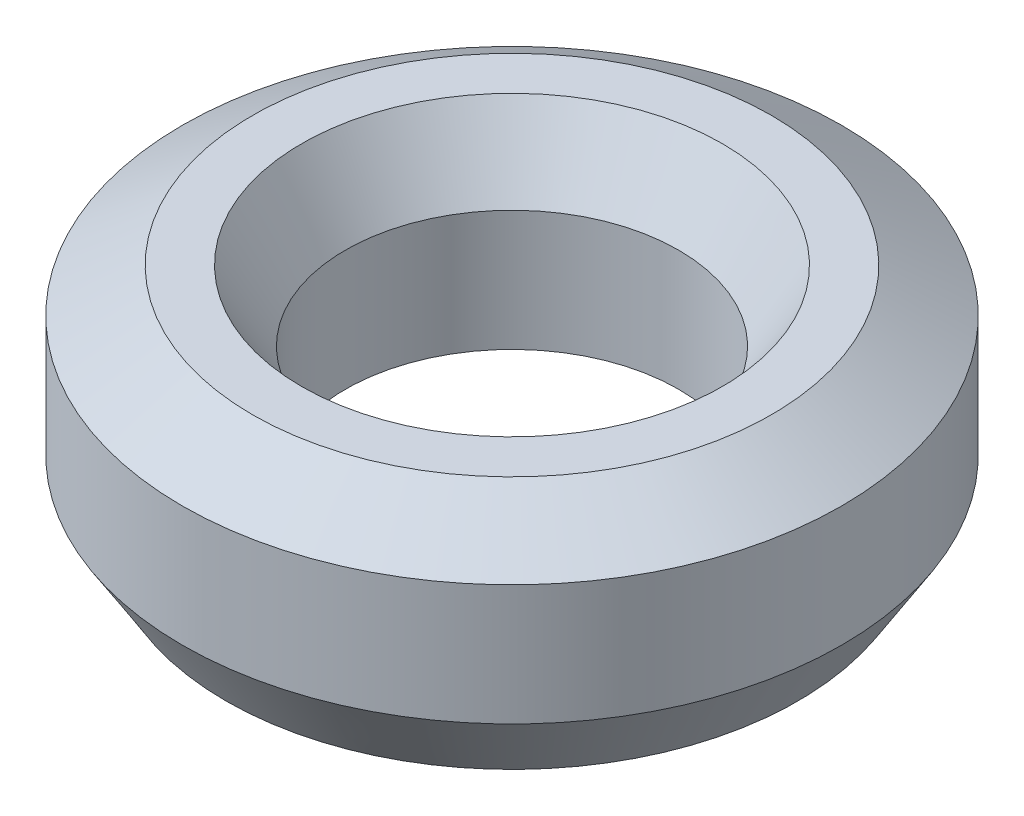
ISO-10303-21;
HEADER;
FILE_DESCRIPTION(('STEP AP214'),'2;1');
FILE_NAME('part.step','',(''),(''),'','','');
FILE_SCHEMA(('AUTOMOTIVE_DESIGN { 1 0 10303 214 1 1 1 1 }'));
ENDSEC;
DATA;
#1=APPLICATION_CONTEXT('core data for automotive mechanical design processes');
#2=APPLICATION_PROTOCOL_DEFINITION('international standard','automotive_design',2000,#1);
#3=PRODUCT_CONTEXT('',#1,'mechanical');
#4=PRODUCT('Part','Part','',(#3));
#5=PRODUCT_RELATED_PRODUCT_CATEGORY('part','',(#4));
#6=PRODUCT_DEFINITION_FORMATION('','',#4);
#7=PRODUCT_DEFINITION_CONTEXT('part definition',#1,'design');
#8=PRODUCT_DEFINITION('design','',#6,#7);
#9=PRODUCT_DEFINITION_SHAPE('','',#8);
#10=(LENGTH_UNIT() NAMED_UNIT(*) SI_UNIT(.MILLI.,.METRE.));
#11=(NAMED_UNIT(*) PLANE_ANGLE_UNIT() SI_UNIT($,.RADIAN.));
#12=(NAMED_UNIT(*) SI_UNIT($,.STERADIAN.) SOLID_ANGLE_UNIT());
#13=UNCERTAINTY_MEASURE_WITH_UNIT(LENGTH_MEASURE(1.E-05),#10,'distance_accuracy_value','');
#14=(GEOMETRIC_REPRESENTATION_CONTEXT(3) GLOBAL_UNCERTAINTY_ASSIGNED_CONTEXT((#13)) GLOBAL_UNIT_ASSIGNED_CONTEXT((#10,
#11,#12)) REPRESENTATION_CONTEXT('',''));
#15=CARTESIAN_POINT('',(0.,0.,0.));
#16=DIRECTION('',(0.,0.,1.));
#17=DIRECTION('',(1.,0.,0.));
#18=AXIS2_PLACEMENT_3D('',#15,#16,#17);
#19=CARTESIAN_POINT('',(0.,19.5687559896404,0.));
#20=DIRECTION('',(0.,-1.,0.));
#21=DIRECTION('',(0.,0.,-1.));
#22=AXIS2_PLACEMENT_3D('',#19,#20,#21);
#23=CYLINDRICAL_SURFACE('',#22,27.5);
#24=CARTESIAN_POINT('',(0.,5.86489268810925,0.));
#25=DIRECTION('',(0.,1.,0.));
#26=DIRECTION('',(0.,0.,1.));
#27=AXIS2_PLACEMENT_3D('',#24,#25,#26);
#28=CIRCLE('',#27,27.5);
#29=CARTESIAN_POINT('',(0.,5.86489268810925,27.5));
#30=VERTEX_POINT('',#29);
#31=EDGE_CURVE('E10',#30,#30,#28,.T.);
#32=ORIENTED_EDGE('',*,*,#31,.T.);
#33=EDGE_LOOP('',(#32));
#34=FACE_BOUND('',#33,.T.);
#35=CARTESIAN_POINT('',(0.,15.9188003643487,0.));
#36=DIRECTION('',(0.,1.,0.));
#37=DIRECTION('',(0.,0.,1.));
#38=AXIS2_PLACEMENT_3D('',#35,#36,#37);
#39=CIRCLE('',#38,27.5);
#40=CARTESIAN_POINT('',(0.,15.9188003643487,27.5));
#41=VERTEX_POINT('',#40);
#42=EDGE_CURVE('E50',#41,#41,#39,.F.);
#43=ORIENTED_EDGE('',*,*,#42,.T.);
#44=EDGE_LOOP('',(#43));
#45=FACE_BOUND('',#44,.T.);
#46=ADVANCED_FACE('F39',(#34,#45),#23,.T.);
#47=CARTESIAN_POINT('',(0.,19.5687559896404,0.));
#48=DIRECTION('',(0.,1.,0.));
#49=DIRECTION('',(0.,0.,1.));
#50=AXIS2_PLACEMENT_3D('',#47,#48,#49);
#51=PLANE('',#50);
#52=CARTESIAN_POINT('',(0.,19.5687559896404,0.));
#53=DIRECTION('',(0.,1.,0.));
#54=DIRECTION('',(0.,0.,1.));
#55=AXIS2_PLACEMENT_3D('',#52,#53,#54);
#56=CIRCLE('',#55,17.5476063171311);
#57=CARTESIAN_POINT('',(0.,19.5687559896404,17.5476063171311));
#58=VERTEX_POINT('',#57);
#59=EDGE_CURVE('E58',#58,#58,#56,.F.);
#60=ORIENTED_EDGE('',*,*,#59,.T.);
#61=EDGE_LOOP('',(#60));
#62=FACE_BOUND('',#61,.T.);
#63=CARTESIAN_POINT('',(0.,19.5687559896404,0.));
#64=DIRECTION('',(0.,1.,0.));
#65=DIRECTION('',(0.,0.,1.));
#66=AXIS2_PLACEMENT_3D('',#63,#64,#65);
#67=CIRCLE('',#66,21.6351073118907);
#68=CARTESIAN_POINT('',(0.,19.5687559896404,21.6351073118907));
#69=VERTEX_POINT('',#68);
#70=EDGE_CURVE('E61',#69,#69,#67,.T.);
#71=ORIENTED_EDGE('',*,*,#70,.T.);
#72=EDGE_LOOP('',(#71));
#73=FACE_BOUND('',#72,.T.);
#74=ADVANCED_FACE('F88',(#62,#73),#51,.T.);
#75=CARTESIAN_POINT('',(0.,0.,0.));
#76=DIRECTION('',(0.,1.,0.));
#77=DIRECTION('',(0.,0.,1.));
#78=AXIS2_PLACEMENT_3D('',#75,#76,#77);
#79=PLANE('',#78);
#80=CARTESIAN_POINT('',(0.,0.,0.));
#81=DIRECTION('',(0.,1.,0.));
#82=DIRECTION('',(0.,0.,1.));
#83=AXIS2_PLACEMENT_3D('',#80,#81,#82);
#84=CIRCLE('',#83,19.7625433799486);
#85=CARTESIAN_POINT('',(0.,0.,19.7625433799486));
#86=VERTEX_POINT('',#85);
#87=EDGE_CURVE('E51',#86,#86,#84,.T.);
#88=ORIENTED_EDGE('',*,*,#87,.T.);
#89=EDGE_LOOP('',(#88));
#90=FACE_BOUND('',#89,.T.);
#91=CARTESIAN_POINT('',(0.,0.,0.));
#92=DIRECTION('',(0.,1.,0.));
#93=DIRECTION('',(0.,0.,1.));
#94=AXIS2_PLACEMENT_3D('',#91,#92,#93);
#95=CIRCLE('',#94,23.8500443747083);
#96=CARTESIAN_POINT('',(0.,0.,23.8500443747083));
#97=VERTEX_POINT('',#96);
#98=EDGE_CURVE('E54',#97,#97,#95,.F.);
#99=ORIENTED_EDGE('',*,*,#98,.T.);
#100=EDGE_LOOP('',(#99));
#101=FACE_BOUND('',#100,.T.);
#102=ADVANCED_FACE('F83',(#90,#101),#79,.F.);
#103=CARTESIAN_POINT('',(0.,19.5687559896404,0.));
#104=DIRECTION('',(0.,-1.,0.));
#105=DIRECTION('',(0.,0.,-1.));
#106=AXIS2_PLACEMENT_3D('',#103,#104,#105);
#107=CYLINDRICAL_SURFACE('',#106,13.8976506918394);
#108=CARTESIAN_POINT('',(0.,13.7038633015312,0.));
#109=DIRECTION('',(0.,1.,0.));
#110=DIRECTION('',(0.,0.,1.));
#111=AXIS2_PLACEMENT_3D('',#108,#109,#110);
#112=CIRCLE('',#111,13.8976506918394);
#113=CARTESIAN_POINT('',(0.,13.7038633015312,13.8976506918394));
#114=VERTEX_POINT('',#113);
#115=EDGE_CURVE('E67',#114,#114,#112,.T.);
#116=ORIENTED_EDGE('',*,*,#115,.T.);
#117=EDGE_LOOP('',(#116));
#118=FACE_BOUND('',#117,.T.);
#119=CARTESIAN_POINT('',(0.,3.64995562529169,0.));
#120=DIRECTION('',(0.,1.,0.));
#121=DIRECTION('',(0.,0.,1.));
#122=AXIS2_PLACEMENT_3D('',#119,#120,#121);
#123=CIRCLE('',#122,13.8976506918394);
#124=CARTESIAN_POINT('',(0.,3.64995562529169,13.8976506918394));
#125=VERTEX_POINT('',#124);
#126=EDGE_CURVE('E69',#125,#125,#123,.F.);
#127=ORIENTED_EDGE('',*,*,#126,.T.);
#128=EDGE_LOOP('',(#127));
#129=FACE_BOUND('',#128,.T.);
#130=ADVANCED_FACE('F71',(#118,#129),#107,.F.);
#131=CARTESIAN_POINT('',(0.,13.7038633015312,0.));
#132=DIRECTION('',(0.,1.,0.));
#133=DIRECTION('',(0.,0.,1.));
#134=AXIS2_PLACEMENT_3D('',#131,#132,#133);
#135=CONICAL_SURFACE('',#134,13.8976506918394,0.556684011448836);
#136=ORIENTED_EDGE('',*,*,#59,.F.);
#137=EDGE_LOOP('',(#136));
#138=FACE_BOUND('',#137,.T.);
#139=ORIENTED_EDGE('',*,*,#115,.F.);
#140=EDGE_LOOP('',(#139));
#141=FACE_BOUND('',#140,.T.);
#142=ADVANCED_FACE('F77',(#138,#141),#135,.F.);
#143=CARTESIAN_POINT('',(0.,0.,0.));
#144=DIRECTION('',(0.,-1.,0.));
#145=DIRECTION('',(0.,0.,-1.));
#146=AXIS2_PLACEMENT_3D('',#143,#144,#145);
#147=CONICAL_SURFACE('',#146,19.7625433799486,1.01411231534606);
#148=ORIENTED_EDGE('',*,*,#126,.F.);
#149=EDGE_LOOP('',(#148));
#150=FACE_BOUND('',#149,.T.);
#151=ORIENTED_EDGE('',*,*,#87,.F.);
#152=EDGE_LOOP('',(#151));
#153=FACE_BOUND('',#152,.T.);
#154=ADVANCED_FACE('F73',(#150,#153),#147,.F.);
#155=CARTESIAN_POINT('',(0.,5.86489268810925,0.));
#156=DIRECTION('',(0.,1.,0.));
#157=DIRECTION('',(0.,0.,1.));
#158=AXIS2_PLACEMENT_3D('',#155,#156,#157);
#159=CONICAL_SURFACE('',#158,27.5,0.556684011448835);
#160=CARTESIAN_POINT('',(0.,0.,23.8500443747083));
#161=CARTESIAN_POINT('',(0.,0.0610926321678048,23.8880647458051));
#162=CARTESIAN_POINT('',(0.,0.122185264335609,23.9260851169019));
#163=CARTESIAN_POINT('',(0.,0.244370528671218,24.0021258590955));
#164=CARTESIAN_POINT('',(0.,0.305463160839023,24.0401462301922));
#165=CARTESIAN_POINT('',(0.,0.427648425174632,24.1161869723858));
#166=CARTESIAN_POINT('',(0.,0.488741057342437,24.1542073434826));
#167=CARTESIAN_POINT('',(0.,0.610926321678047,24.2302480856762));
#168=CARTESIAN_POINT('',(0.,0.672018953845851,24.268268456773));
#169=CARTESIAN_POINT('',(0.,0.79420421818146,24.3443091989665));
#170=CARTESIAN_POINT('',(0.,0.855296850349265,24.3823295700633));
#171=CARTESIAN_POINT('',(0.,0.977482114684875,24.4583703122569));
#172=CARTESIAN_POINT('',(0.,1.03857474685268,24.4963906833537));
#173=CARTESIAN_POINT('',(0.,1.16076001118829,24.5724314255473));
#174=CARTESIAN_POINT('',(0.,1.22185264335609,24.6104517966441));
#175=CARTESIAN_POINT('',(0.,1.3440379076917,24.6864925388376));
#176=CARTESIAN_POINT('',(0.,1.40513053985951,24.7245129099344));
#177=CARTESIAN_POINT('',(0.,1.52731580419512,24.800553652128));
#178=CARTESIAN_POINT('',(0.,1.58840843636292,24.8385740232248));
#179=CARTESIAN_POINT('',(0.,1.71059370069853,24.9146147654184));
#180=CARTESIAN_POINT('',(0.,1.77168633286634,24.9526351365152));
#181=CARTESIAN_POINT('',(0.,1.89387159720195,25.0286758787087));
#182=CARTESIAN_POINT('',(0.,1.95496422936975,25.0666962498055));
#183=CARTESIAN_POINT('',(0.,2.07714949370536,25.1427369919991));
#184=CARTESIAN_POINT('',(0.,2.13824212587316,25.1807573630959));
#185=CARTESIAN_POINT('',(0.,2.26042739020877,25.2567981052895));
#186=CARTESIAN_POINT('',(0.,2.32152002237658,25.2948184763863));
#187=CARTESIAN_POINT('',(0.,2.44370528671219,25.3708592185798));
#188=CARTESIAN_POINT('',(0.,2.50479791887999,25.4088795896766));
#189=CARTESIAN_POINT('',(0.,2.6269831832156,25.4849203318702));
#190=CARTESIAN_POINT('',(0.,2.68807581538341,25.522940702967));
#191=CARTESIAN_POINT('',(0.,2.81026107971902,25.5989814451606));
#192=CARTESIAN_POINT('',(0.,2.87135371188682,25.6370018162574));
#193=CARTESIAN_POINT('',(0.,2.99353897622243,25.7130425584509));
#194=CARTESIAN_POINT('',(0.,3.05463160839024,25.7510629295477));
#195=CARTESIAN_POINT('',(0.,3.17681687272585,25.8271036717413));
#196=CARTESIAN_POINT('',(0.,3.23790950489365,25.8651240428381));
#197=CARTESIAN_POINT('',(0.,3.36009476922926,25.9411647850317));
#198=CARTESIAN_POINT('',(0.,3.42118740139706,25.9791851561285));
#199=CARTESIAN_POINT('',(0.,3.54337266573267,26.055225898322));
#200=CARTESIAN_POINT('',(0.,3.60446529790048,26.0932462694188));
#201=CARTESIAN_POINT('',(0.,3.72665056223609,26.1692870116124));
#202=CARTESIAN_POINT('',(0.,3.78774319440389,26.2073073827092));
#203=CARTESIAN_POINT('',(0.,3.9099284587395,26.2833481249028));
#204=CARTESIAN_POINT('',(0.,3.97102109090731,26.3213684959996));
#205=CARTESIAN_POINT('',(0.,4.09320635524292,26.3974092381931));
#206=CARTESIAN_POINT('',(0.,4.15429898741072,26.4354296092899));
#207=CARTESIAN_POINT('',(0.,4.27648425174633,26.5114703514835));
#208=CARTESIAN_POINT('',(0.,4.33757688391414,26.5494907225803));
#209=CARTESIAN_POINT('',(0.,4.45976214824974,26.6255314647739));
#210=CARTESIAN_POINT('',(0.,4.52085478041755,26.6635518358707));
#211=CARTESIAN_POINT('',(0.,4.64304004475316,26.7395925780642));
#212=CARTESIAN_POINT('',(0.,4.70413267692096,26.777612949161));
#213=CARTESIAN_POINT('',(0.,4.82631794125657,26.8536536913546));
#214=CARTESIAN_POINT('',(0.,4.88741057342438,26.8916740624514));
#215=CARTESIAN_POINT('',(0.,5.00959583775999,26.967714804645));
#216=CARTESIAN_POINT('',(0.,5.07068846992779,27.0057351757417));
#217=CARTESIAN_POINT('',(0.,5.1928737342634,27.0817759179353));
#218=CARTESIAN_POINT('',(0.,5.25396636643121,27.1197962890321));
#219=CARTESIAN_POINT('',(0.,5.37615163076681,27.1958370312257));
#220=CARTESIAN_POINT('',(0.,5.43724426293462,27.2338574023225));
#221=CARTESIAN_POINT('',(0.,5.55942952727023,27.3098981445161));
#222=CARTESIAN_POINT('',(0.,5.62052215943803,27.3479185156128));
#223=CARTESIAN_POINT('',(0.,5.74270742377364,27.4239592578064));
#224=CARTESIAN_POINT('',(0.,5.80380005594145,27.4619796289032));
#225=CARTESIAN_POINT('',(0.,5.86489268810925,27.5));
#226=B_SPLINE_CURVE_WITH_KNOTS('',3,(#160,#161,#162,#163,#164,#165,#166,#167,#168,#169,#170,
#171,#172,#173,#174,#175,#176,#177,#178,#179,#180,#181,#182,#183,#184,#185,#186,#187,#188,#189,
#190,#191,#192,#193,#194,#195,#196,#197,#198,#199,#200,#201,#202,#203,#204,#205,#206,#207,#208,
#209,#210,#211,#212,#213,#214,#215,#216,#217,#218,#219,#220,#221,#222,#223,#224,#225),
.UNSPECIFIED.,.F.,.F.,(4,2,2,2,2,2,2,2,2,2,2,2,2,2,2,2,2,2,2,2,2,2,2,2,2,2,2,2,2,2,2,2,4),(0.,
0.215872010487124,0.431744020974252,0.647616031461377,0.863488041948503,1.07936005243563,
1.29523206292275,1.51110407340988,1.72697608389701,1.94284809438413,2.15872010487126,
2.37459211535839,2.59046412584551,2.80633613633264,3.02220814681976,3.23808015730689,
3.45395216779402,3.66982417828114,3.88569618876827,4.10156819925539,4.31744020974252,
4.53331222022965,4.74918423071677,4.9650562412039,5.18092825169102,5.39680026217815,
5.61267227266528,5.8285442831524,6.04441629363953,6.26028830412665,6.47616031461378,
6.69203232510091,6.90790433558803),.UNSPECIFIED.);
#227=EDGE_CURVE('BSEAM76',#97,#30,#226,.T.);
#228=ORIENTED_EDGE('',*,*,#98,.F.);
#229=ORIENTED_EDGE('',*,*,#31,.F.);
#230=ORIENTED_EDGE('',*,*,#227,.T.);
#231=ORIENTED_EDGE('',*,*,#227,.F.);
#232=EDGE_LOOP('',(#228,#230,#229,#231));
#233=FACE_BOUND('',#232,.T.);
#234=ADVANCED_FACE('F76',(#233),#159,.T.);
#235=CARTESIAN_POINT('',(0.,19.5687559896404,0.));
#236=DIRECTION('',(0.,-1.,0.));
#237=DIRECTION('',(0.,0.,-1.));
#238=AXIS2_PLACEMENT_3D('',#235,#236,#237);
#239=CONICAL_SURFACE('',#238,21.6351073118907,1.01411231534606);
#240=ORIENTED_EDGE('',*,*,#42,.F.);
#241=EDGE_LOOP('',(#240));
#242=FACE_BOUND('',#241,.T.);
#243=ORIENTED_EDGE('',*,*,#70,.F.);
#244=EDGE_LOOP('',(#243));
#245=FACE_BOUND('',#244,.T.);
#246=ADVANCED_FACE('F45',(#242,#245),#239,.T.);
#247=CLOSED_SHELL('',(#46,#74,#102,#130,#142,#154,#234,#246));
#248=MANIFOLD_SOLID_BREP('B2',#247);
#249=ADVANCED_BREP_SHAPE_REPRESENTATION('',(#18,#248),#14);
#250=SHAPE_DEFINITION_REPRESENTATION(#9,#249);
ENDSEC;
END-ISO-10303-21;
